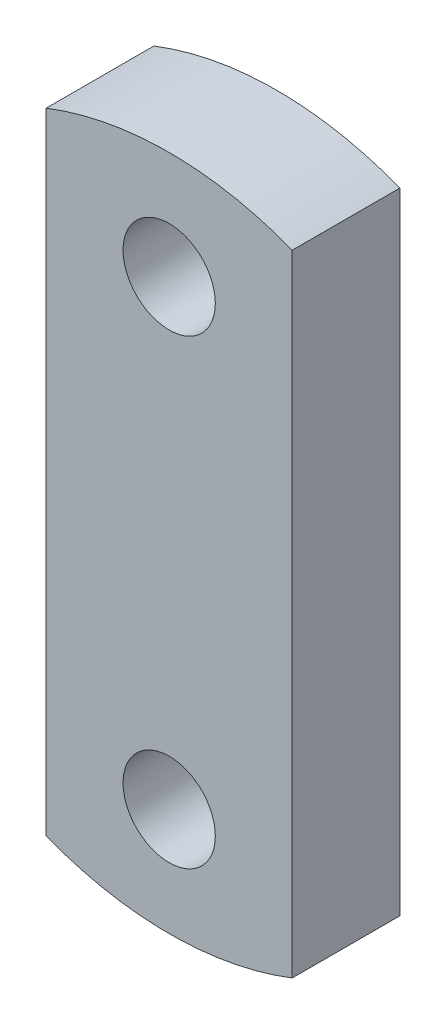
ISO-10303-21;
HEADER;
FILE_DESCRIPTION(('STEP AP214'),'2;1');
FILE_NAME('part.step','',(''),(''),'','','');
FILE_SCHEMA(('AUTOMOTIVE_DESIGN { 1 0 10303 214 1 1 1 1 }'));
ENDSEC;
DATA;
#1=APPLICATION_CONTEXT('core data for automotive mechanical design processes');
#2=APPLICATION_PROTOCOL_DEFINITION('international standard','automotive_design',2000,#1);
#3=PRODUCT_CONTEXT('',#1,'mechanical');
#4=PRODUCT('Part','Part','',(#3));
#5=PRODUCT_RELATED_PRODUCT_CATEGORY('part','',(#4));
#6=PRODUCT_DEFINITION_FORMATION('','',#4);
#7=PRODUCT_DEFINITION_CONTEXT('part definition',#1,'design');
#8=PRODUCT_DEFINITION('design','',#6,#7);
#9=PRODUCT_DEFINITION_SHAPE('','',#8);
#10=(LENGTH_UNIT() NAMED_UNIT(*) SI_UNIT(.MILLI.,.METRE.));
#11=(NAMED_UNIT(*) PLANE_ANGLE_UNIT() SI_UNIT($,.RADIAN.));
#12=(NAMED_UNIT(*) SI_UNIT($,.STERADIAN.) SOLID_ANGLE_UNIT());
#13=UNCERTAINTY_MEASURE_WITH_UNIT(LENGTH_MEASURE(1.E-05),#10,'distance_accuracy_value','');
#14=(GEOMETRIC_REPRESENTATION_CONTEXT(3) GLOBAL_UNCERTAINTY_ASSIGNED_CONTEXT((#13)) GLOBAL_UNIT_ASSIGNED_CONTEXT((#10,
#11,#12)) REPRESENTATION_CONTEXT('',''));
#15=CARTESIAN_POINT('',(0.,0.,0.));
#16=DIRECTION('',(0.,0.,1.));
#17=DIRECTION('',(1.,0.,0.));
#18=AXIS2_PLACEMENT_3D('',#15,#16,#17);
#19=CARTESIAN_POINT('',(0.,0.,35.));
#20=DIRECTION('',(0.,0.,1.));
#21=DIRECTION('',(1.,0.,0.));
#22=AXIS2_PLACEMENT_3D('',#19,#20,#21);
#23=PLANE('',#22);
#24=CARTESIAN_POINT('',(0.,75.,35.));
#25=DIRECTION('',(0.,0.,1.));
#26=DIRECTION('',(1.,0.,0.));
#27=AXIS2_PLACEMENT_3D('',#24,#25,#26);
#28=CIRCLE('',#27,15.);
#29=CARTESIAN_POINT('',(15.,75.,35.));
#30=VERTEX_POINT('',#29);
#31=EDGE_CURVE('E104',#30,#30,#28,.T.);
#32=ORIENTED_EDGE('',*,*,#31,.F.);
#33=EDGE_LOOP('',(#32));
#34=FACE_BOUND('',#33,.T.);
#35=CARTESIAN_POINT('',(0.,0.,35.));
#36=DIRECTION('',(0.,0.,1.));
#37=DIRECTION('',(1.,0.,0.));
#38=AXIS2_PLACEMENT_3D('',#35,#36,#37);
#39=CIRCLE('',#38,110.);
#40=CARTESIAN_POINT('',(-40.,-102.469507659596,35.));
#41=VERTEX_POINT('',#40);
#42=CARTESIAN_POINT('',(40.,-102.469507659596,35.));
#43=VERTEX_POINT('',#42);
#44=EDGE_CURVE('E89',#41,#43,#39,.T.);
#45=ORIENTED_EDGE('',*,*,#44,.T.);
#46=DIRECTION('',(0.,1.,0.));
#47=VECTOR('',#46,1.);
#48=CARTESIAN_POINT('',(40.,-102.469507659596,35.));
#49=LINE('',#48,#47);
#50=CARTESIAN_POINT('',(40.,102.469507659596,35.));
#51=VERTEX_POINT('',#50);
#52=EDGE_CURVE('E84',#43,#51,#49,.T.);
#53=ORIENTED_EDGE('',*,*,#52,.T.);
#54=CARTESIAN_POINT('',(0.,0.,35.));
#55=DIRECTION('',(0.,0.,1.));
#56=DIRECTION('',(1.,0.,0.));
#57=AXIS2_PLACEMENT_3D('',#54,#55,#56);
#58=CIRCLE('',#57,110.);
#59=CARTESIAN_POINT('',(-40.,102.469507659596,35.));
#60=VERTEX_POINT('',#59);
#61=EDGE_CURVE('E87',#51,#60,#58,.T.);
#62=ORIENTED_EDGE('',*,*,#61,.T.);
#63=DIRECTION('',(0.,-1.,0.));
#64=VECTOR('',#63,1.);
#65=CARTESIAN_POINT('',(-40.,102.469507659596,35.));
#66=LINE('',#65,#64);
#67=EDGE_CURVE('E54',#60,#41,#66,.T.);
#68=ORIENTED_EDGE('',*,*,#67,.T.);
#69=EDGE_LOOP('',(#45,#53,#62,#68));
#70=FACE_BOUND('',#69,.T.);
#71=CARTESIAN_POINT('',(0.,-75.,35.));
#72=DIRECTION('',(0.,0.,1.));
#73=DIRECTION('',(1.,0.,0.));
#74=AXIS2_PLACEMENT_3D('',#71,#72,#73);
#75=CIRCLE('',#74,15.);
#76=CARTESIAN_POINT('',(15.,-75.,35.));
#77=VERTEX_POINT('',#76);
#78=EDGE_CURVE('E119',#77,#77,#75,.T.);
#79=ORIENTED_EDGE('',*,*,#78,.F.);
#80=EDGE_LOOP('',(#79));
#81=FACE_BOUND('',#80,.T.);
#82=ADVANCED_FACE('F37',(#34,#70,#81),#23,.T.);
#83=CARTESIAN_POINT('',(0.,0.,0.));
#84=DIRECTION('',(0.,0.,1.));
#85=DIRECTION('',(1.,0.,0.));
#86=AXIS2_PLACEMENT_3D('',#83,#84,#85);
#87=PLANE('',#86);
#88=CARTESIAN_POINT('',(0.,0.,0.));
#89=DIRECTION('',(0.,0.,1.));
#90=DIRECTION('',(1.,0.,0.));
#91=AXIS2_PLACEMENT_3D('',#88,#89,#90);
#92=CIRCLE('',#91,110.);
#93=CARTESIAN_POINT('',(-40.,-102.469507659596,0.));
#94=VERTEX_POINT('',#93);
#95=CARTESIAN_POINT('',(40.,-102.469507659596,0.));
#96=VERTEX_POINT('',#95);
#97=EDGE_CURVE('E101',#94,#96,#92,.T.);
#98=ORIENTED_EDGE('',*,*,#97,.F.);
#99=DIRECTION('',(0.,-1.,0.));
#100=VECTOR('',#99,1.);
#101=CARTESIAN_POINT('',(-40.,102.469507659596,0.));
#102=LINE('',#101,#100);
#103=CARTESIAN_POINT('',(-40.,102.469507659596,0.));
#104=VERTEX_POINT('',#103);
#105=EDGE_CURVE('E77',#104,#94,#102,.T.);
#106=ORIENTED_EDGE('',*,*,#105,.F.);
#107=CARTESIAN_POINT('',(0.,0.,0.));
#108=DIRECTION('',(0.,0.,1.));
#109=DIRECTION('',(1.,0.,0.));
#110=AXIS2_PLACEMENT_3D('',#107,#108,#109);
#111=CIRCLE('',#110,110.);
#112=CARTESIAN_POINT('',(40.,102.469507659596,0.));
#113=VERTEX_POINT('',#112);
#114=EDGE_CURVE('E71',#113,#104,#111,.T.);
#115=ORIENTED_EDGE('',*,*,#114,.F.);
#116=DIRECTION('',(0.,1.,0.));
#117=VECTOR('',#116,1.);
#118=CARTESIAN_POINT('',(40.,-102.469507659596,0.));
#119=LINE('',#118,#117);
#120=EDGE_CURVE('E93',#96,#113,#119,.T.);
#121=ORIENTED_EDGE('',*,*,#120,.F.);
#122=EDGE_LOOP('',(#98,#106,#115,#121));
#123=FACE_BOUND('',#122,.T.);
#124=CARTESIAN_POINT('',(0.,75.,0.));
#125=DIRECTION('',(0.,0.,1.));
#126=DIRECTION('',(1.,0.,0.));
#127=AXIS2_PLACEMENT_3D('',#124,#125,#126);
#128=CIRCLE('',#127,15.);
#129=CARTESIAN_POINT('',(15.,75.,0.));
#130=VERTEX_POINT('',#129);
#131=EDGE_CURVE('E116',#130,#130,#128,.T.);
#132=ORIENTED_EDGE('',*,*,#131,.T.);
#133=EDGE_LOOP('',(#132));
#134=FACE_BOUND('',#133,.T.);
#135=CARTESIAN_POINT('',(0.,-75.,0.));
#136=DIRECTION('',(0.,0.,1.));
#137=DIRECTION('',(1.,0.,0.));
#138=AXIS2_PLACEMENT_3D('',#135,#136,#137);
#139=CIRCLE('',#138,15.);
#140=CARTESIAN_POINT('',(15.,-75.,0.));
#141=VERTEX_POINT('',#140);
#142=EDGE_CURVE('E122',#141,#141,#139,.T.);
#143=ORIENTED_EDGE('',*,*,#142,.T.);
#144=EDGE_LOOP('',(#143));
#145=FACE_BOUND('',#144,.T.);
#146=ADVANCED_FACE('F112',(#123,#134,#145),#87,.F.);
#147=CARTESIAN_POINT('',(0.,0.,35.));
#148=DIRECTION('',(0.,0.,-1.));
#149=DIRECTION('',(-1.,0.,0.));
#150=AXIS2_PLACEMENT_3D('',#147,#148,#149);
#151=CYLINDRICAL_SURFACE('',#150,110.);
#152=ORIENTED_EDGE('',*,*,#97,.T.);
#153=DIRECTION('',(0.,0.,-1.));
#154=VECTOR('',#153,1.);
#155=CARTESIAN_POINT('',(40.,-102.469507659596,35.));
#156=LINE('',#155,#154);
#157=EDGE_CURVE('E11',#43,#96,#156,.T.);
#158=ORIENTED_EDGE('',*,*,#157,.F.);
#159=ORIENTED_EDGE('',*,*,#44,.F.);
#160=DIRECTION('',(0.,0.,-1.));
#161=VECTOR('',#160,1.);
#162=CARTESIAN_POINT('',(-40.,-102.469507659596,35.));
#163=LINE('',#162,#161);
#164=EDGE_CURVE('E97',#41,#94,#163,.T.);
#165=ORIENTED_EDGE('',*,*,#164,.T.);
#166=EDGE_LOOP('',(#152,#158,#159,#165));
#167=FACE_BOUND('',#166,.T.);
#168=ADVANCED_FACE('F39',(#167),#151,.T.);
#169=CARTESIAN_POINT('',(40.,-102.469507659596,35.));
#170=DIRECTION('',(-1.,0.,0.));
#171=DIRECTION('',(0.,0.,1.));
#172=AXIS2_PLACEMENT_3D('',#169,#170,#171);
#173=PLANE('',#172);
#174=ORIENTED_EDGE('',*,*,#120,.T.);
#175=DIRECTION('',(0.,0.,-1.));
#176=VECTOR('',#175,1.);
#177=CARTESIAN_POINT('',(40.,102.469507659596,35.));
#178=LINE('',#177,#176);
#179=EDGE_CURVE('E46',#51,#113,#178,.T.);
#180=ORIENTED_EDGE('',*,*,#179,.F.);
#181=ORIENTED_EDGE('',*,*,#52,.F.);
#182=ORIENTED_EDGE('',*,*,#157,.T.);
#183=EDGE_LOOP('',(#174,#180,#181,#182));
#184=FACE_BOUND('',#183,.T.);
#185=ADVANCED_FACE('F92',(#184),#173,.F.);
#186=CARTESIAN_POINT('',(0.,0.,35.));
#187=DIRECTION('',(0.,0.,-1.));
#188=DIRECTION('',(-1.,0.,0.));
#189=AXIS2_PLACEMENT_3D('',#186,#187,#188);
#190=CYLINDRICAL_SURFACE('',#189,110.);
#191=ORIENTED_EDGE('',*,*,#114,.T.);
#192=DIRECTION('',(0.,0.,-1.));
#193=VECTOR('',#192,1.);
#194=CARTESIAN_POINT('',(-40.,102.469507659596,35.));
#195=LINE('',#194,#193);
#196=EDGE_CURVE('E94',#60,#104,#195,.T.);
#197=ORIENTED_EDGE('',*,*,#196,.F.);
#198=ORIENTED_EDGE('',*,*,#61,.F.);
#199=ORIENTED_EDGE('',*,*,#179,.T.);
#200=EDGE_LOOP('',(#191,#197,#198,#199));
#201=FACE_BOUND('',#200,.T.);
#202=ADVANCED_FACE('F95',(#201),#190,.T.);
#203=CARTESIAN_POINT('',(-40.,102.469507659596,35.));
#204=DIRECTION('',(1.,0.,0.));
#205=DIRECTION('',(0.,1.,0.));
#206=AXIS2_PLACEMENT_3D('',#203,#204,#205);
#207=PLANE('',#206);
#208=ORIENTED_EDGE('',*,*,#105,.T.);
#209=ORIENTED_EDGE('',*,*,#164,.F.);
#210=ORIENTED_EDGE('',*,*,#67,.F.);
#211=ORIENTED_EDGE('',*,*,#196,.T.);
#212=EDGE_LOOP('',(#208,#209,#210,#211));
#213=FACE_BOUND('',#212,.T.);
#214=ADVANCED_FACE('F109',(#213),#207,.F.);
#215=CARTESIAN_POINT('',(0.,75.,35.));
#216=DIRECTION('',(0.,0.,-1.));
#217=DIRECTION('',(-1.,0.,0.));
#218=AXIS2_PLACEMENT_3D('',#215,#216,#217);
#219=CYLINDRICAL_SURFACE('',#218,15.);
#220=ORIENTED_EDGE('',*,*,#31,.T.);
#221=EDGE_LOOP('',(#220));
#222=FACE_BOUND('',#221,.T.);
#223=ORIENTED_EDGE('',*,*,#131,.F.);
#224=EDGE_LOOP('',(#223));
#225=FACE_BOUND('',#224,.T.);
#226=ADVANCED_FACE('F139',(#222,#225),#219,.F.);
#227=CARTESIAN_POINT('',(0.,-75.,35.));
#228=DIRECTION('',(0.,0.,-1.));
#229=DIRECTION('',(-1.,0.,0.));
#230=AXIS2_PLACEMENT_3D('',#227,#228,#229);
#231=CYLINDRICAL_SURFACE('',#230,15.);
#232=ORIENTED_EDGE('',*,*,#78,.T.);
#233=EDGE_LOOP('',(#232));
#234=FACE_BOUND('',#233,.T.);
#235=ORIENTED_EDGE('',*,*,#142,.F.);
#236=EDGE_LOOP('',(#235));
#237=FACE_BOUND('',#236,.T.);
#238=ADVANCED_FACE('F128',(#234,#237),#231,.F.);
#239=CLOSED_SHELL('',(#82,#146,#168,#185,#202,#214,#226,#238));
#240=MANIFOLD_SOLID_BREP('B2',#239);
#241=ADVANCED_BREP_SHAPE_REPRESENTATION('',(#18,#240),#14);
#242=SHAPE_DEFINITION_REPRESENTATION(#9,#241);
ENDSEC;
END-ISO-10303-21;
